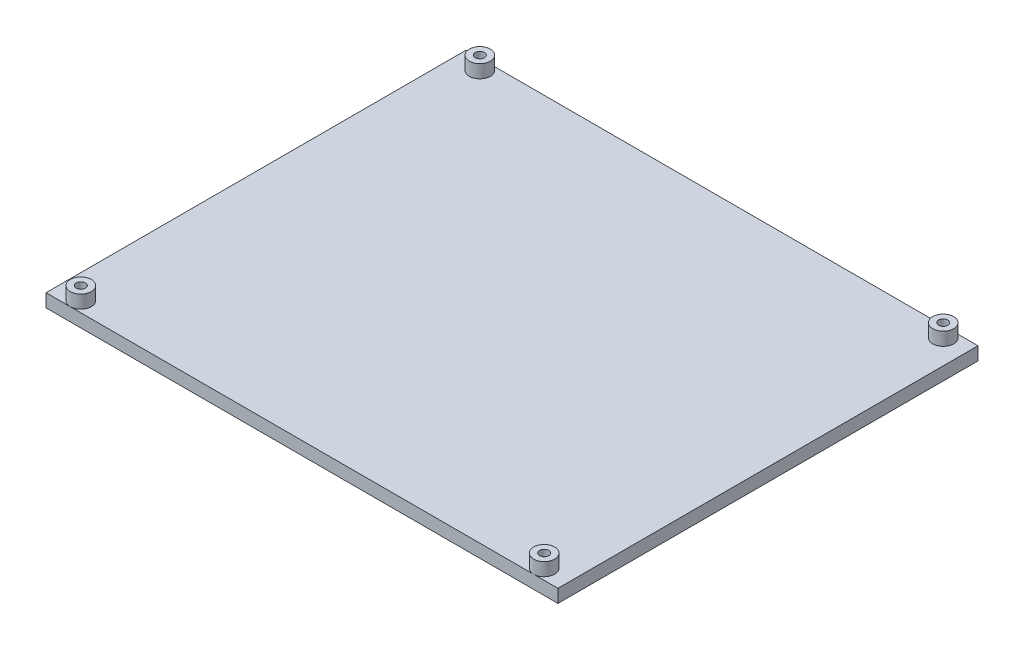
ISO-10303-21;
HEADER;
FILE_DESCRIPTION(('STEP AP214'),'2;1');
FILE_NAME('part.step','',(''),(''),'','','');
FILE_SCHEMA(('AUTOMOTIVE_DESIGN { 1 0 10303 214 1 1 1 1 }'));
ENDSEC;
DATA;
#1=APPLICATION_CONTEXT('core data for automotive mechanical design processes');
#2=APPLICATION_PROTOCOL_DEFINITION('international standard','automotive_design',2000,#1);
#3=PRODUCT_CONTEXT('',#1,'mechanical');
#4=PRODUCT('Part','Part','',(#3));
#5=PRODUCT_RELATED_PRODUCT_CATEGORY('part','',(#4));
#6=PRODUCT_DEFINITION_FORMATION('','',#4);
#7=PRODUCT_DEFINITION_CONTEXT('part definition',#1,'design');
#8=PRODUCT_DEFINITION('design','',#6,#7);
#9=PRODUCT_DEFINITION_SHAPE('','',#8);
#10=(LENGTH_UNIT() NAMED_UNIT(*) SI_UNIT(.MILLI.,.METRE.));
#11=(NAMED_UNIT(*) PLANE_ANGLE_UNIT() SI_UNIT($,.RADIAN.));
#12=(NAMED_UNIT(*) SI_UNIT($,.STERADIAN.) SOLID_ANGLE_UNIT());
#13=UNCERTAINTY_MEASURE_WITH_UNIT(LENGTH_MEASURE(1.E-05),#10,'distance_accuracy_value','');
#14=(GEOMETRIC_REPRESENTATION_CONTEXT(3) GLOBAL_UNCERTAINTY_ASSIGNED_CONTEXT((#13)) GLOBAL_UNIT_ASSIGNED_CONTEXT((#10,
#11,#12)) REPRESENTATION_CONTEXT('',''));
#15=CARTESIAN_POINT('',(0.,0.,0.));
#16=DIRECTION('',(0.,0.,1.));
#17=DIRECTION('',(1.,0.,0.));
#18=AXIS2_PLACEMENT_3D('',#15,#16,#17);
#19=CARTESIAN_POINT('',(0.,5.,0.));
#20=DIRECTION('',(0.,1.,0.));
#21=DIRECTION('',(0.,0.,1.));
#22=AXIS2_PLACEMENT_3D('',#19,#20,#21);
#23=PLANE('',#22);
#24=DIRECTION('',(1.,0.,0.));
#25=VECTOR('',#24,1.);
#26=CARTESIAN_POINT('',(-92.5,5.,80.));
#27=LINE('',#26,#25);
#28=CARTESIAN_POINT('',(-97.5,5.,80.));
#29=VERTEX_POINT('',#28);
#30=CARTESIAN_POINT('',(-88.25,5.,80.));
#31=VERTEX_POINT('',#30);
#32=EDGE_CURVE('E120',#29,#31,#27,.T.);
#33=ORIENTED_EDGE('',*,*,#32,.T.);
#34=CARTESIAN_POINT('',(-88.25,5.,76.));
#35=DIRECTION('',(0.,1.,0.));
#36=DIRECTION('',(0.,0.,1.));
#37=AXIS2_PLACEMENT_3D('',#34,#35,#36);
#38=CIRCLE('',#37,4.00000000000001);
#39=EDGE_CURVE('E161',#31,#31,#38,.T.);
#40=ORIENTED_EDGE('',*,*,#39,.F.);
#41=CARTESIAN_POINT('',(88.25,5.,80.));
#42=VERTEX_POINT('',#41);
#43=EDGE_CURVE('E118',#31,#42,#27,.T.);
#44=ORIENTED_EDGE('',*,*,#43,.T.);
#45=CARTESIAN_POINT('',(88.25,5.,76.));
#46=DIRECTION('',(0.,1.,0.));
#47=DIRECTION('',(0.,0.,1.));
#48=AXIS2_PLACEMENT_3D('',#45,#46,#47);
#49=CIRCLE('',#48,4.00000000000001);
#50=EDGE_CURVE('E146',#42,#42,#49,.T.);
#51=ORIENTED_EDGE('',*,*,#50,.F.);
#52=CARTESIAN_POINT('',(97.5,5.,80.));
#53=VERTEX_POINT('',#52);
#54=EDGE_CURVE('E116',#42,#53,#27,.T.);
#55=ORIENTED_EDGE('',*,*,#54,.T.);
#56=DIRECTION('',(0.,0.,-1.));
#57=VECTOR('',#56,1.);
#58=CARTESIAN_POINT('',(97.5,5.,80.));
#59=LINE('',#58,#57);
#60=CARTESIAN_POINT('',(97.5,5.,-80.));
#61=VERTEX_POINT('',#60);
#62=EDGE_CURVE('E56',#53,#61,#59,.T.);
#63=ORIENTED_EDGE('',*,*,#62,.T.);
#64=DIRECTION('',(-1.,0.,0.));
#65=VECTOR('',#64,1.);
#66=CARTESIAN_POINT('',(92.5,5.,-80.));
#67=LINE('',#66,#65);
#68=CARTESIAN_POINT('',(88.25,5.,-80.));
#69=VERTEX_POINT('',#68);
#70=EDGE_CURVE('E108',#61,#69,#67,.T.);
#71=ORIENTED_EDGE('',*,*,#70,.T.);
#72=CARTESIAN_POINT('',(88.25,5.,-76.));
#73=DIRECTION('',(0.,1.,0.));
#74=DIRECTION('',(0.,0.,1.));
#75=AXIS2_PLACEMENT_3D('',#72,#73,#74);
#76=CIRCLE('',#75,4.00000000000001);
#77=EDGE_CURVE('E105',#69,#69,#76,.T.);
#78=ORIENTED_EDGE('',*,*,#77,.F.);
#79=CARTESIAN_POINT('',(-88.25,5.,-80.));
#80=VERTEX_POINT('',#79);
#81=EDGE_CURVE('E101',#69,#80,#67,.T.);
#82=ORIENTED_EDGE('',*,*,#81,.T.);
#83=CARTESIAN_POINT('',(-88.25,5.,-76.));
#84=DIRECTION('',(0.,1.,0.));
#85=DIRECTION('',(0.,0.,1.));
#86=AXIS2_PLACEMENT_3D('',#83,#84,#85);
#87=CIRCLE('',#86,4.00000000000001);
#88=EDGE_CURVE('E103',#80,#80,#87,.T.);
#89=ORIENTED_EDGE('',*,*,#88,.F.);
#90=CARTESIAN_POINT('',(-97.5,5.,-80.));
#91=VERTEX_POINT('',#90);
#92=EDGE_CURVE('E87',#80,#91,#67,.T.);
#93=ORIENTED_EDGE('',*,*,#92,.T.);
#94=DIRECTION('',(0.,0.,1.));
#95=VECTOR('',#94,1.);
#96=CARTESIAN_POINT('',(-97.5,5.,80.));
#97=LINE('',#96,#95);
#98=EDGE_CURVE('E115',#91,#29,#97,.T.);
#99=ORIENTED_EDGE('',*,*,#98,.T.);
#100=EDGE_LOOP('',(#33,#40,#44,#51,#55,#63,#71,#78,#82,#89,#93,#99));
#101=FACE_BOUND('',#100,.T.);
#102=ADVANCED_FACE('F39',(#101),#23,.T.);
#103=CARTESIAN_POINT('',(0.,0.,0.));
#104=DIRECTION('',(0.,1.,0.));
#105=DIRECTION('',(0.,0.,1.));
#106=AXIS2_PLACEMENT_3D('',#103,#104,#105);
#107=PLANE('',#106);
#108=DIRECTION('',(-1.,0.,0.));
#109=VECTOR('',#108,1.);
#110=CARTESIAN_POINT('',(-92.5,0.,-80.));
#111=LINE('',#110,#109);
#112=CARTESIAN_POINT('',(97.5,0.,-80.));
#113=VERTEX_POINT('',#112);
#114=CARTESIAN_POINT('',(-97.5,0.,-80.));
#115=VERTEX_POINT('',#114);
#116=EDGE_CURVE('E80',#113,#115,#111,.T.);
#117=ORIENTED_EDGE('',*,*,#116,.F.);
#118=DIRECTION('',(0.,0.,-1.));
#119=VECTOR('',#118,1.);
#120=CARTESIAN_POINT('',(97.5,0.,80.));
#121=LINE('',#120,#119);
#122=CARTESIAN_POINT('',(97.5,0.,80.));
#123=VERTEX_POINT('',#122);
#124=EDGE_CURVE('E111',#123,#113,#121,.T.);
#125=ORIENTED_EDGE('',*,*,#124,.F.);
#126=DIRECTION('',(1.,0.,0.));
#127=VECTOR('',#126,1.);
#128=CARTESIAN_POINT('',(92.5,0.,80.));
#129=LINE('',#128,#127);
#130=CARTESIAN_POINT('',(-97.5,0.,80.));
#131=VERTEX_POINT('',#130);
#132=EDGE_CURVE('E73',#131,#123,#129,.T.);
#133=ORIENTED_EDGE('',*,*,#132,.F.);
#134=DIRECTION('',(0.,0.,1.));
#135=VECTOR('',#134,1.);
#136=CARTESIAN_POINT('',(-97.5,0.,80.));
#137=LINE('',#136,#135);
#138=EDGE_CURVE('E125',#115,#131,#137,.T.);
#139=ORIENTED_EDGE('',*,*,#138,.F.);
#140=EDGE_LOOP('',(#117,#125,#133,#139));
#141=FACE_BOUND('',#140,.T.);
#142=CARTESIAN_POINT('',(-88.25,0.,-76.));
#143=DIRECTION('',(0.,1.,0.));
#144=DIRECTION('',(0.,0.,1.));
#145=AXIS2_PLACEMENT_3D('',#142,#143,#144);
#146=CIRCLE('',#145,1.75);
#147=CARTESIAN_POINT('',(-88.25,0.,-74.25));
#148=VERTEX_POINT('',#147);
#149=EDGE_CURVE('E126',#148,#148,#146,.T.);
#150=ORIENTED_EDGE('',*,*,#149,.T.);
#151=EDGE_LOOP('',(#150));
#152=FACE_BOUND('',#151,.T.);
#153=CARTESIAN_POINT('',(88.25,0.,-76.));
#154=DIRECTION('',(0.,1.,0.));
#155=DIRECTION('',(0.,0.,1.));
#156=AXIS2_PLACEMENT_3D('',#153,#154,#155);
#157=CIRCLE('',#156,1.75);
#158=CARTESIAN_POINT('',(88.25,0.,-74.25));
#159=VERTEX_POINT('',#158);
#160=EDGE_CURVE('E182',#159,#159,#157,.T.);
#161=ORIENTED_EDGE('',*,*,#160,.T.);
#162=EDGE_LOOP('',(#161));
#163=FACE_BOUND('',#162,.T.);
#164=CARTESIAN_POINT('',(88.25,0.,76.));
#165=DIRECTION('',(0.,1.,0.));
#166=DIRECTION('',(0.,0.,1.));
#167=AXIS2_PLACEMENT_3D('',#164,#165,#166);
#168=CIRCLE('',#167,1.75);
#169=CARTESIAN_POINT('',(88.25,0.,77.75));
#170=VERTEX_POINT('',#169);
#171=EDGE_CURVE('E179',#170,#170,#168,.T.);
#172=ORIENTED_EDGE('',*,*,#171,.T.);
#173=EDGE_LOOP('',(#172));
#174=FACE_BOUND('',#173,.T.);
#175=CARTESIAN_POINT('',(-88.25,0.,76.));
#176=DIRECTION('',(0.,1.,0.));
#177=DIRECTION('',(0.,0.,1.));
#178=AXIS2_PLACEMENT_3D('',#175,#176,#177);
#179=CIRCLE('',#178,1.75);
#180=CARTESIAN_POINT('',(-88.25,0.,77.75));
#181=VERTEX_POINT('',#180);
#182=EDGE_CURVE('E175',#181,#181,#179,.T.);
#183=ORIENTED_EDGE('',*,*,#182,.T.);
#184=EDGE_LOOP('',(#183));
#185=FACE_BOUND('',#184,.T.);
#186=ADVANCED_FACE('F138',(#141,#152,#163,#174,#185),#107,.F.);
#187=CARTESIAN_POINT('',(-92.5,5.,-80.));
#188=DIRECTION('',(0.,0.,1.));
#189=DIRECTION('',(1.,0.,0.));
#190=AXIS2_PLACEMENT_3D('',#187,#188,#189);
#191=PLANE('',#190);
#192=ORIENTED_EDGE('',*,*,#116,.T.);
#193=DIRECTION('',(0.,-1.,0.));
#194=VECTOR('',#193,1.);
#195=CARTESIAN_POINT('',(-97.5,5.,-80.));
#196=LINE('',#195,#194);
#197=EDGE_CURVE('E11',#91,#115,#196,.T.);
#198=ORIENTED_EDGE('',*,*,#197,.F.);
#199=ORIENTED_EDGE('',*,*,#92,.F.);
#200=ORIENTED_EDGE('',*,*,#81,.F.);
#201=ORIENTED_EDGE('',*,*,#70,.F.);
#202=DIRECTION('',(0.,-1.,0.));
#203=VECTOR('',#202,1.);
#204=CARTESIAN_POINT('',(97.5,5.,-80.));
#205=LINE('',#204,#203);
#206=EDGE_CURVE('E123',#61,#113,#205,.T.);
#207=ORIENTED_EDGE('',*,*,#206,.T.);
#208=EDGE_LOOP('',(#192,#198,#199,#200,#201,#207));
#209=FACE_BOUND('',#208,.T.);
#210=ADVANCED_FACE('F41',(#209),#191,.F.);
#211=CARTESIAN_POINT('',(-97.5,5.,80.));
#212=DIRECTION('',(1.,0.,0.));
#213=DIRECTION('',(0.,0.,-1.));
#214=AXIS2_PLACEMENT_3D('',#211,#212,#213);
#215=PLANE('',#214);
#216=ORIENTED_EDGE('',*,*,#138,.T.);
#217=DIRECTION('',(0.,-1.,0.));
#218=VECTOR('',#217,1.);
#219=CARTESIAN_POINT('',(-97.5,5.,80.));
#220=LINE('',#219,#218);
#221=EDGE_CURVE('E48',#29,#131,#220,.T.);
#222=ORIENTED_EDGE('',*,*,#221,.F.);
#223=ORIENTED_EDGE('',*,*,#98,.F.);
#224=ORIENTED_EDGE('',*,*,#197,.T.);
#225=EDGE_LOOP('',(#216,#222,#223,#224));
#226=FACE_BOUND('',#225,.T.);
#227=ADVANCED_FACE('F137',(#226),#215,.F.);
#228=CARTESIAN_POINT('',(92.5,5.,80.));
#229=DIRECTION('',(0.,0.,-1.));
#230=DIRECTION('',(-1.,0.,0.));
#231=AXIS2_PLACEMENT_3D('',#228,#229,#230);
#232=PLANE('',#231);
#233=ORIENTED_EDGE('',*,*,#132,.T.);
#234=DIRECTION('',(0.,-1.,0.));
#235=VECTOR('',#234,1.);
#236=CARTESIAN_POINT('',(97.5,5.,80.));
#237=LINE('',#236,#235);
#238=EDGE_CURVE('E132',#53,#123,#237,.T.);
#239=ORIENTED_EDGE('',*,*,#238,.F.);
#240=ORIENTED_EDGE('',*,*,#54,.F.);
#241=ORIENTED_EDGE('',*,*,#43,.F.);
#242=ORIENTED_EDGE('',*,*,#32,.F.);
#243=ORIENTED_EDGE('',*,*,#221,.T.);
#244=EDGE_LOOP('',(#233,#239,#240,#241,#242,#243));
#245=FACE_BOUND('',#244,.T.);
#246=ADVANCED_FACE('F134',(#245),#232,.F.);
#247=CARTESIAN_POINT('',(97.5,5.,80.));
#248=DIRECTION('',(-1.,0.,0.));
#249=DIRECTION('',(0.,0.,1.));
#250=AXIS2_PLACEMENT_3D('',#247,#248,#249);
#251=PLANE('',#250);
#252=ORIENTED_EDGE('',*,*,#124,.T.);
#253=ORIENTED_EDGE('',*,*,#206,.F.);
#254=ORIENTED_EDGE('',*,*,#62,.F.);
#255=ORIENTED_EDGE('',*,*,#238,.T.);
#256=EDGE_LOOP('',(#252,#253,#254,#255));
#257=FACE_BOUND('',#256,.T.);
#258=ADVANCED_FACE('F141',(#257),#251,.F.);
#259=CARTESIAN_POINT('',(-88.25,5.,-76.));
#260=DIRECTION('',(0.,-1.,0.));
#261=DIRECTION('',(0.,0.,-1.));
#262=AXIS2_PLACEMENT_3D('',#259,#260,#261);
#263=CYLINDRICAL_SURFACE('',#262,1.75);
#264=ORIENTED_EDGE('',*,*,#149,.F.);
#265=EDGE_LOOP('',(#264));
#266=FACE_BOUND('',#265,.T.);
#267=CARTESIAN_POINT('',(-88.25,10.,-76.));
#268=DIRECTION('',(0.,1.,0.));
#269=DIRECTION('',(0.,0.,1.));
#270=AXIS2_PLACEMENT_3D('',#267,#268,#269);
#271=CIRCLE('',#270,1.75);
#272=CARTESIAN_POINT('',(-88.25,10.,-74.25));
#273=VERTEX_POINT('',#272);
#274=EDGE_CURVE('E169',#273,#273,#271,.T.);
#275=ORIENTED_EDGE('',*,*,#274,.T.);
#276=EDGE_LOOP('',(#275));
#277=FACE_BOUND('',#276,.T.);
#278=ADVANCED_FACE('F188',(#266,#277),#263,.F.);
#279=CARTESIAN_POINT('',(88.25,5.,-76.));
#280=DIRECTION('',(0.,-1.,0.));
#281=DIRECTION('',(0.,0.,-1.));
#282=AXIS2_PLACEMENT_3D('',#279,#280,#281);
#283=CYLINDRICAL_SURFACE('',#282,1.75);
#284=ORIENTED_EDGE('',*,*,#160,.F.);
#285=EDGE_LOOP('',(#284));
#286=FACE_BOUND('',#285,.T.);
#287=CARTESIAN_POINT('',(88.25,10.,-76.));
#288=DIRECTION('',(0.,1.,0.));
#289=DIRECTION('',(0.,0.,1.));
#290=AXIS2_PLACEMENT_3D('',#287,#288,#289);
#291=CIRCLE('',#290,1.75);
#292=CARTESIAN_POINT('',(88.25,10.,-74.25));
#293=VERTEX_POINT('',#292);
#294=EDGE_CURVE('E158',#293,#293,#291,.T.);
#295=ORIENTED_EDGE('',*,*,#294,.T.);
#296=EDGE_LOOP('',(#295));
#297=FACE_BOUND('',#296,.T.);
#298=ADVANCED_FACE('F191',(#286,#297),#283,.F.);
#299=CARTESIAN_POINT('',(88.25,5.,76.));
#300=DIRECTION('',(0.,-1.,0.));
#301=DIRECTION('',(0.,0.,-1.));
#302=AXIS2_PLACEMENT_3D('',#299,#300,#301);
#303=CYLINDRICAL_SURFACE('',#302,1.75);
#304=ORIENTED_EDGE('',*,*,#171,.F.);
#305=EDGE_LOOP('',(#304));
#306=FACE_BOUND('',#305,.T.);
#307=CARTESIAN_POINT('',(88.25,10.,76.));
#308=DIRECTION('',(0.,1.,0.));
#309=DIRECTION('',(0.,0.,1.));
#310=AXIS2_PLACEMENT_3D('',#307,#308,#309);
#311=CIRCLE('',#310,1.75);
#312=CARTESIAN_POINT('',(88.25,10.,77.75));
#313=VERTEX_POINT('',#312);
#314=EDGE_CURVE('E148',#313,#313,#311,.T.);
#315=ORIENTED_EDGE('',*,*,#314,.T.);
#316=EDGE_LOOP('',(#315));
#317=FACE_BOUND('',#316,.T.);
#318=ADVANCED_FACE('F208',(#306,#317),#303,.F.);
#319=CARTESIAN_POINT('',(-88.25,5.,76.));
#320=DIRECTION('',(0.,-1.,0.));
#321=DIRECTION('',(0.,0.,-1.));
#322=AXIS2_PLACEMENT_3D('',#319,#320,#321);
#323=CYLINDRICAL_SURFACE('',#322,1.75);
#324=ORIENTED_EDGE('',*,*,#182,.F.);
#325=EDGE_LOOP('',(#324));
#326=FACE_BOUND('',#325,.T.);
#327=CARTESIAN_POINT('',(-88.25,10.,76.));
#328=DIRECTION('',(0.,1.,0.));
#329=DIRECTION('',(0.,0.,1.));
#330=AXIS2_PLACEMENT_3D('',#327,#328,#329);
#331=CIRCLE('',#330,1.75);
#332=CARTESIAN_POINT('',(-88.25,10.,77.75));
#333=VERTEX_POINT('',#332);
#334=EDGE_CURVE('E155',#333,#333,#331,.T.);
#335=ORIENTED_EDGE('',*,*,#334,.T.);
#336=EDGE_LOOP('',(#335));
#337=FACE_BOUND('',#336,.T.);
#338=ADVANCED_FACE('F198',(#326,#337),#323,.F.);
#339=CARTESIAN_POINT('',(-88.25,10.,-76.));
#340=DIRECTION('',(0.,1.,0.));
#341=DIRECTION('',(0.,0.,1.));
#342=AXIS2_PLACEMENT_3D('',#339,#340,#341);
#343=PLANE('',#342);
#344=CARTESIAN_POINT('',(-88.25,10.,-76.));
#345=DIRECTION('',(0.,1.,0.));
#346=DIRECTION('',(0.,0.,1.));
#347=AXIS2_PLACEMENT_3D('',#344,#345,#346);
#348=CIRCLE('',#347,4.00000000000001);
#349=CARTESIAN_POINT('',(-88.25,10.,-72.));
#350=VERTEX_POINT('',#349);
#351=EDGE_CURVE('E172',#350,#350,#348,.T.);
#352=ORIENTED_EDGE('',*,*,#351,.T.);
#353=EDGE_LOOP('',(#352));
#354=FACE_BOUND('',#353,.T.);
#355=ORIENTED_EDGE('',*,*,#274,.F.);
#356=EDGE_LOOP('',(#355));
#357=FACE_BOUND('',#356,.T.);
#358=ADVANCED_FACE('F195',(#354,#357),#343,.T.);
#359=CARTESIAN_POINT('',(-88.25,10.,-76.));
#360=DIRECTION('',(0.,-1.,0.));
#361=DIRECTION('',(0.,0.,-1.));
#362=AXIS2_PLACEMENT_3D('',#359,#360,#361);
#363=CYLINDRICAL_SURFACE('',#362,4.00000000000001);
#364=ORIENTED_EDGE('',*,*,#351,.F.);
#365=EDGE_LOOP('',(#364));
#366=FACE_BOUND('',#365,.T.);
#367=ORIENTED_EDGE('',*,*,#88,.T.);
#368=EDGE_LOOP('',(#367));
#369=FACE_BOUND('',#368,.T.);
#370=ADVANCED_FACE('F197',(#366,#369),#363,.T.);
#371=CARTESIAN_POINT('',(88.25,10.,-76.));
#372=DIRECTION('',(0.,1.,0.));
#373=DIRECTION('',(0.,0.,1.));
#374=AXIS2_PLACEMENT_3D('',#371,#372,#373);
#375=PLANE('',#374);
#376=CARTESIAN_POINT('',(88.25,10.,-76.));
#377=DIRECTION('',(0.,1.,0.));
#378=DIRECTION('',(0.,0.,1.));
#379=AXIS2_PLACEMENT_3D('',#376,#377,#378);
#380=CIRCLE('',#379,4.00000000000001);
#381=CARTESIAN_POINT('',(88.25,10.,-72.));
#382=VERTEX_POINT('',#381);
#383=EDGE_CURVE('E152',#382,#382,#380,.T.);
#384=ORIENTED_EDGE('',*,*,#383,.T.);
#385=EDGE_LOOP('',(#384));
#386=FACE_BOUND('',#385,.T.);
#387=ORIENTED_EDGE('',*,*,#294,.F.);
#388=EDGE_LOOP('',(#387));
#389=FACE_BOUND('',#388,.T.);
#390=ADVANCED_FACE('F205',(#386,#389),#375,.T.);
#391=CARTESIAN_POINT('',(88.25,10.,-76.));
#392=DIRECTION('',(0.,-1.,0.));
#393=DIRECTION('',(0.,0.,-1.));
#394=AXIS2_PLACEMENT_3D('',#391,#392,#393);
#395=CYLINDRICAL_SURFACE('',#394,4.00000000000001);
#396=ORIENTED_EDGE('',*,*,#383,.F.);
#397=EDGE_LOOP('',(#396));
#398=FACE_BOUND('',#397,.T.);
#399=ORIENTED_EDGE('',*,*,#77,.T.);
#400=EDGE_LOOP('',(#399));
#401=FACE_BOUND('',#400,.T.);
#402=ADVANCED_FACE('F282',(#398,#401),#395,.T.);
#403=CARTESIAN_POINT('',(88.25,10.,76.));
#404=DIRECTION('',(0.,1.,0.));
#405=DIRECTION('',(0.,0.,1.));
#406=AXIS2_PLACEMENT_3D('',#403,#404,#405);
#407=PLANE('',#406);
#408=CARTESIAN_POINT('',(88.25,10.,76.));
#409=DIRECTION('',(0.,1.,0.));
#410=DIRECTION('',(0.,0.,1.));
#411=AXIS2_PLACEMENT_3D('',#408,#409,#410);
#412=CIRCLE('',#411,4.00000000000001);
#413=CARTESIAN_POINT('',(88.25,10.,80.));
#414=VERTEX_POINT('',#413);
#415=EDGE_CURVE('E149',#414,#414,#412,.T.);
#416=ORIENTED_EDGE('',*,*,#415,.T.);
#417=EDGE_LOOP('',(#416));
#418=FACE_BOUND('',#417,.T.);
#419=ORIENTED_EDGE('',*,*,#314,.F.);
#420=EDGE_LOOP('',(#419));
#421=FACE_BOUND('',#420,.T.);
#422=ADVANCED_FACE('F292',(#418,#421),#407,.T.);
#423=CARTESIAN_POINT('',(88.25,10.,76.));
#424=DIRECTION('',(0.,-1.,0.));
#425=DIRECTION('',(0.,0.,-1.));
#426=AXIS2_PLACEMENT_3D('',#423,#424,#425);
#427=CYLINDRICAL_SURFACE('',#426,4.00000000000001);
#428=ORIENTED_EDGE('',*,*,#415,.F.);
#429=EDGE_LOOP('',(#428));
#430=FACE_BOUND('',#429,.T.);
#431=ORIENTED_EDGE('',*,*,#50,.T.);
#432=EDGE_LOOP('',(#431));
#433=FACE_BOUND('',#432,.T.);
#434=ADVANCED_FACE('F302',(#430,#433),#427,.T.);
#435=CARTESIAN_POINT('',(-88.25,10.,76.));
#436=DIRECTION('',(0.,1.,0.));
#437=DIRECTION('',(0.,0.,1.));
#438=AXIS2_PLACEMENT_3D('',#435,#436,#437);
#439=PLANE('',#438);
#440=CARTESIAN_POINT('',(-88.25,10.,76.));
#441=DIRECTION('',(0.,1.,0.));
#442=DIRECTION('',(0.,0.,1.));
#443=AXIS2_PLACEMENT_3D('',#440,#441,#442);
#444=CIRCLE('',#443,4.00000000000001);
#445=CARTESIAN_POINT('',(-88.25,10.,80.));
#446=VERTEX_POINT('',#445);
#447=EDGE_CURVE('E164',#446,#446,#444,.T.);
#448=ORIENTED_EDGE('',*,*,#447,.T.);
#449=EDGE_LOOP('',(#448));
#450=FACE_BOUND('',#449,.T.);
#451=ORIENTED_EDGE('',*,*,#334,.F.);
#452=EDGE_LOOP('',(#451));
#453=FACE_BOUND('',#452,.T.);
#454=ADVANCED_FACE('F312',(#450,#453),#439,.T.);
#455=CARTESIAN_POINT('',(-88.25,10.,76.));
#456=DIRECTION('',(0.,-1.,0.));
#457=DIRECTION('',(0.,0.,-1.));
#458=AXIS2_PLACEMENT_3D('',#455,#456,#457);
#459=CYLINDRICAL_SURFACE('',#458,4.00000000000001);
#460=ORIENTED_EDGE('',*,*,#447,.F.);
#461=EDGE_LOOP('',(#460));
#462=FACE_BOUND('',#461,.T.);
#463=ORIENTED_EDGE('',*,*,#39,.T.);
#464=EDGE_LOOP('',(#463));
#465=FACE_BOUND('',#464,.T.);
#466=ADVANCED_FACE('F322',(#462,#465),#459,.T.);
#467=CLOSED_SHELL('',(#102,#186,#210,#227,#246,#258,#278,#298,#318,#338,#358,#370,#390,#402,
#422,#434,#454,#466));
#468=MANIFOLD_SOLID_BREP('B2',#467);
#469=ADVANCED_BREP_SHAPE_REPRESENTATION('',(#18,#468),#14);
#470=SHAPE_DEFINITION_REPRESENTATION(#9,#469);
ENDSEC;
END-ISO-10303-21;
